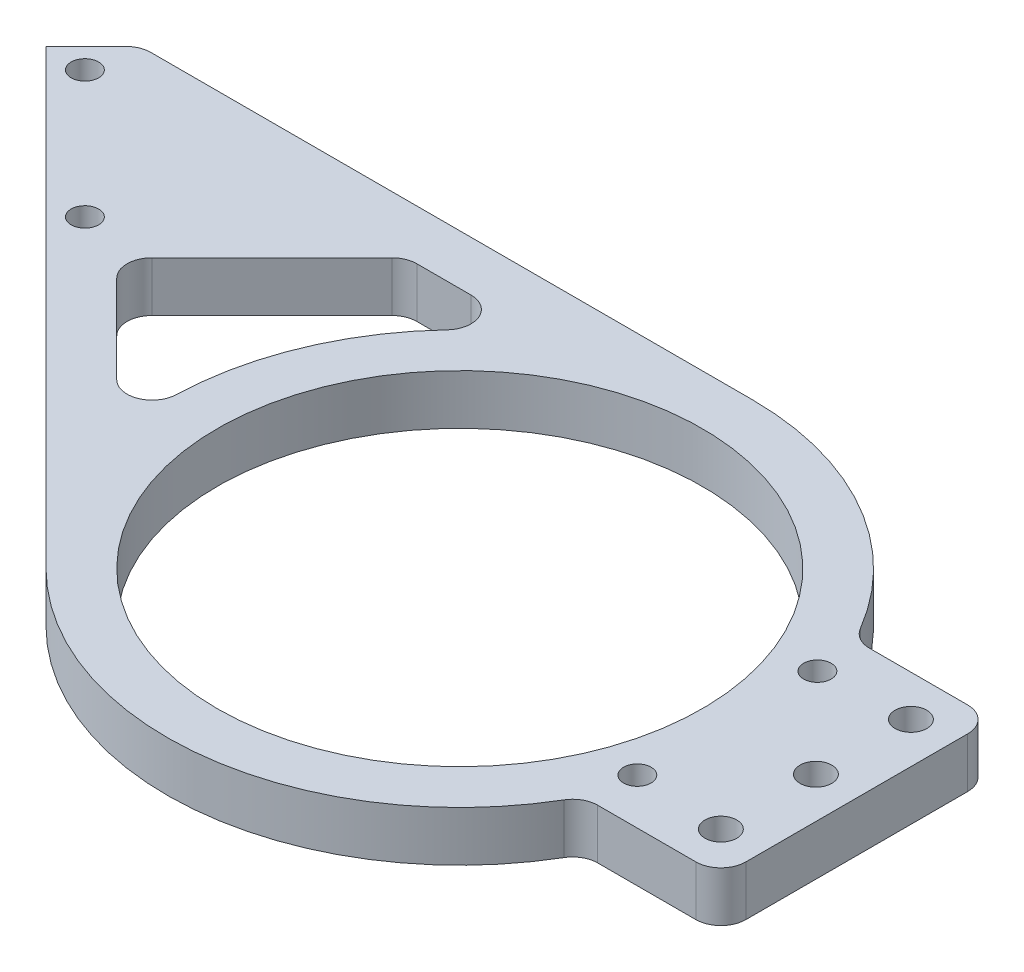
ISO-10303-21;
HEADER;
FILE_DESCRIPTION(('STEP AP214'),'2;1');
FILE_NAME('part.step','',(''),(''),'','','');
FILE_SCHEMA(('AUTOMOTIVE_DESIGN { 1 0 10303 214 1 1 1 1 }'));
ENDSEC;
DATA;
#1=APPLICATION_CONTEXT('core data for automotive mechanical design processes');
#2=APPLICATION_PROTOCOL_DEFINITION('international standard','automotive_design',2000,#1);
#3=PRODUCT_CONTEXT('',#1,'mechanical');
#4=PRODUCT('Part','Part','',(#3));
#5=PRODUCT_RELATED_PRODUCT_CATEGORY('part','',(#4));
#6=PRODUCT_DEFINITION_FORMATION('','',#4);
#7=PRODUCT_DEFINITION_CONTEXT('part definition',#1,'design');
#8=PRODUCT_DEFINITION('design','',#6,#7);
#9=PRODUCT_DEFINITION_SHAPE('','',#8);
#10=(LENGTH_UNIT() NAMED_UNIT(*) SI_UNIT(.MILLI.,.METRE.));
#11=(NAMED_UNIT(*) PLANE_ANGLE_UNIT() SI_UNIT($,.RADIAN.));
#12=(NAMED_UNIT(*) SI_UNIT($,.STERADIAN.) SOLID_ANGLE_UNIT());
#13=UNCERTAINTY_MEASURE_WITH_UNIT(LENGTH_MEASURE(1.E-05),#10,'distance_accuracy_value','');
#14=(GEOMETRIC_REPRESENTATION_CONTEXT(3) GLOBAL_UNCERTAINTY_ASSIGNED_CONTEXT((#13)) GLOBAL_UNIT_ASSIGNED_CONTEXT((#10,
#11,#12)) REPRESENTATION_CONTEXT('',''));
#15=CARTESIAN_POINT('',(0.,0.,0.));
#16=DIRECTION('',(0.,0.,1.));
#17=DIRECTION('',(1.,0.,0.));
#18=AXIS2_PLACEMENT_3D('',#15,#16,#17);
#19=CARTESIAN_POINT('',(-131.787026343642,-5.,-49.0555329448167));
#20=DIRECTION('',(-0.707106781186548,0.,-0.707106781186548));
#21=DIRECTION('',(-0.707106781186548,0.,0.707106781186548));
#22=AXIS2_PLACEMENT_3D('',#19,#20,#21);
#23=PLANE('',#22);
#24=DIRECTION('',(-0.707106781186548,0.,0.707106781186548));
#25=VECTOR('',#24,1.);
#26=CARTESIAN_POINT('',(-131.787026343642,5.,-49.0555329448167));
#27=LINE('',#26,#25);
#28=CARTESIAN_POINT('',(-123.807025382526,5.,-57.0355339059327));
#29=VERTEX_POINT('',#28);
#30=CARTESIAN_POINT('',(-131.787026343642,5.,-49.0555329448167));
#31=VERTEX_POINT('',#30);
#32=EDGE_CURVE('E215',#29,#31,#27,.T.);
#33=ORIENTED_EDGE('',*,*,#32,.F.);
#34=DIRECTION('',(0.,1.,0.));
#35=VECTOR('',#34,1.);
#36=CARTESIAN_POINT('',(-123.807025382526,-5.,-57.0355339059327));
#37=LINE('',#36,#35);
#38=CARTESIAN_POINT('',(-123.807025382526,-5.,-57.0355339059327));
#39=VERTEX_POINT('',#38);
#40=EDGE_CURVE('E182',#29,#39,#37,.F.);
#41=ORIENTED_EDGE('',*,*,#40,.T.);
#42=DIRECTION('',(-0.707106781186548,0.,0.707106781186548));
#43=VECTOR('',#42,1.);
#44=CARTESIAN_POINT('',(-131.787026343642,-5.,-49.0555329448167));
#45=LINE('',#44,#43);
#46=CARTESIAN_POINT('',(-131.787026343642,-5.,-49.0555329448167));
#47=VERTEX_POINT('',#46);
#48=EDGE_CURVE('E177',#39,#47,#45,.T.);
#49=ORIENTED_EDGE('',*,*,#48,.T.);
#50=DIRECTION('',(0.,1.,0.));
#51=VECTOR('',#50,1.);
#52=CARTESIAN_POINT('',(-131.787026343642,-5.,-49.0555329448167));
#53=LINE('',#52,#51);
#54=EDGE_CURVE('E180',#47,#31,#53,.T.);
#55=ORIENTED_EDGE('',*,*,#54,.T.);
#56=EDGE_LOOP('',(#33,#41,#49,#55));
#57=FACE_BOUND('',#56,.T.);
#58=ADVANCED_FACE('F33',(#57),#23,.T.);
#59=CARTESIAN_POINT('',(-122.342559288459,-5.,-58.5));
#60=DIRECTION('',(0.,0.,-1.));
#61=DIRECTION('',(-1.,0.,0.));
#62=AXIS2_PLACEMENT_3D('',#59,#60,#61);
#63=PLANE('',#62);
#64=DIRECTION('',(-1.,0.,0.));
#65=VECTOR('',#64,1.);
#66=CARTESIAN_POINT('',(-122.342559288459,-5.,-58.5));
#67=LINE('',#66,#65);
#68=CARTESIAN_POINT('',(0.,-5.,-58.5));
#69=VERTEX_POINT('',#68);
#70=CARTESIAN_POINT('',(-120.271491476594,-5.,-58.5));
#71=VERTEX_POINT('',#70);
#72=EDGE_CURVE('E195',#69,#71,#67,.T.);
#73=ORIENTED_EDGE('',*,*,#72,.T.);
#74=DIRECTION('',(0.,1.,0.));
#75=VECTOR('',#74,1.);
#76=CARTESIAN_POINT('',(-120.271491476594,-5.,-58.5));
#77=LINE('',#76,#75);
#78=CARTESIAN_POINT('',(-120.271491476594,5.,-58.5));
#79=VERTEX_POINT('',#78);
#80=EDGE_CURVE('E238',#71,#79,#77,.T.);
#81=ORIENTED_EDGE('',*,*,#80,.T.);
#82=DIRECTION('',(-1.,0.,0.));
#83=VECTOR('',#82,1.);
#84=CARTESIAN_POINT('',(-122.342559288459,5.,-58.5));
#85=LINE('',#84,#83);
#86=CARTESIAN_POINT('',(0.,5.,-58.5));
#87=VERTEX_POINT('',#86);
#88=EDGE_CURVE('E186',#87,#79,#85,.T.);
#89=ORIENTED_EDGE('',*,*,#88,.F.);
#90=DIRECTION('',(0.,1.,0.));
#91=VECTOR('',#90,1.);
#92=CARTESIAN_POINT('',(0.,-5.,-58.5));
#93=LINE('',#92,#91);
#94=EDGE_CURVE('E235',#69,#87,#93,.T.);
#95=ORIENTED_EDGE('',*,*,#94,.F.);
#96=EDGE_LOOP('',(#73,#81,#89,#95));
#97=FACE_BOUND('',#96,.T.);
#98=ADVANCED_FACE('F375',(#97),#63,.T.);
#99=CARTESIAN_POINT('',(0.,-5.,0.));
#100=DIRECTION('',(0.,1.,0.));
#101=DIRECTION('',(0.,0.,1.));
#102=AXIS2_PLACEMENT_3D('',#99,#100,#101);
#103=CYLINDRICAL_SURFACE('',#102,58.5);
#104=CARTESIAN_POINT('',(0.,5.,0.));
#105=DIRECTION('',(0.,1.,0.));
#106=DIRECTION('',(0.,0.,1.));
#107=AXIS2_PLACEMENT_3D('',#104,#105,#106);
#108=CIRCLE('',#107,58.5);
#109=CARTESIAN_POINT('',(50.4344066800632,5.,-29.6415354330709));
#110=VERTEX_POINT('',#109);
#111=EDGE_CURVE('E231',#110,#87,#108,.T.);
#112=ORIENTED_EDGE('',*,*,#111,.F.);
#113=DIRECTION('',(0.,1.,0.));
#114=VECTOR('',#113,1.);
#115=CARTESIAN_POINT('',(50.4344066800632,-5.,-29.6415354330709));
#116=LINE('',#115,#114);
#117=CARTESIAN_POINT('',(50.4344066800632,-5.,-29.6415354330709));
#118=VERTEX_POINT('',#117);
#119=EDGE_CURVE('E272',#110,#118,#116,.F.);
#120=ORIENTED_EDGE('',*,*,#119,.T.);
#121=CARTESIAN_POINT('',(0.,-5.,0.));
#122=DIRECTION('',(0.,1.,0.));
#123=DIRECTION('',(0.,0.,1.));
#124=AXIS2_PLACEMENT_3D('',#121,#122,#123);
#125=CIRCLE('',#124,58.5);
#126=EDGE_CURVE('E211',#118,#69,#125,.T.);
#127=ORIENTED_EDGE('',*,*,#126,.T.);
#128=ORIENTED_EDGE('',*,*,#94,.T.);
#129=EDGE_LOOP('',(#112,#120,#127,#128));
#130=FACE_BOUND('',#129,.T.);
#131=ADVANCED_FACE('F426',(#130),#103,.T.);
#132=CARTESIAN_POINT('',(51.8051095452949,-5.,-27.175));
#133=DIRECTION('',(0.,0.,-1.));
#134=DIRECTION('',(-1.,0.,0.));
#135=AXIS2_PLACEMENT_3D('',#132,#133,#134);
#136=PLANE('',#135);
#137=DIRECTION('',(-1.,0.,0.));
#138=VECTOR('',#137,1.);
#139=CARTESIAN_POINT('',(51.8051095452949,5.,-27.175));
#140=LINE('',#139,#138);
#141=CARTESIAN_POINT('',(74.375,5.,-27.175));
#142=VERTEX_POINT('',#141);
#143=CARTESIAN_POINT('',(54.7450397296413,5.,-27.175));
#144=VERTEX_POINT('',#143);
#145=EDGE_CURVE('E228',#142,#144,#140,.T.);
#146=ORIENTED_EDGE('',*,*,#145,.F.);
#147=DIRECTION('',(0.,1.,0.));
#148=VECTOR('',#147,1.);
#149=CARTESIAN_POINT('',(74.375,-5.,-27.175));
#150=LINE('',#149,#148);
#151=CARTESIAN_POINT('',(74.375,-5.,-27.175));
#152=VERTEX_POINT('',#151);
#153=EDGE_CURVE('E262',#142,#152,#150,.F.);
#154=ORIENTED_EDGE('',*,*,#153,.T.);
#155=DIRECTION('',(-1.,0.,0.));
#156=VECTOR('',#155,1.);
#157=CARTESIAN_POINT('',(51.8051095452949,-5.,-27.175));
#158=LINE('',#157,#156);
#159=CARTESIAN_POINT('',(54.7450397296413,-5.,-27.175));
#160=VERTEX_POINT('',#159);
#161=EDGE_CURVE('E208',#152,#160,#158,.T.);
#162=ORIENTED_EDGE('',*,*,#161,.T.);
#163=DIRECTION('',(0.,-1.,0.));
#164=VECTOR('',#163,1.);
#165=CARTESIAN_POINT('',(54.7450397296413,5.,-27.175));
#166=LINE('',#165,#164);
#167=EDGE_CURVE('E259',#160,#144,#166,.F.);
#168=ORIENTED_EDGE('',*,*,#167,.T.);
#169=EDGE_LOOP('',(#146,#154,#162,#168));
#170=FACE_BOUND('',#169,.T.);
#171=ADVANCED_FACE('F390',(#170),#136,.T.);
#172=CARTESIAN_POINT('',(79.375,-5.,-27.175));
#173=DIRECTION('',(1.,0.,0.));
#174=DIRECTION('',(0.,0.,-1.));
#175=AXIS2_PLACEMENT_3D('',#172,#173,#174);
#176=PLANE('',#175);
#177=DIRECTION('',(0.,0.,-1.));
#178=VECTOR('',#177,1.);
#179=CARTESIAN_POINT('',(79.375,-5.,-27.175));
#180=LINE('',#179,#178);
#181=CARTESIAN_POINT('',(79.375,-5.,22.175));
#182=VERTEX_POINT('',#181);
#183=CARTESIAN_POINT('',(79.375,-5.,-22.175));
#184=VERTEX_POINT('',#183);
#185=EDGE_CURVE('E205',#182,#184,#180,.T.);
#186=ORIENTED_EDGE('',*,*,#185,.T.);
#187=DIRECTION('',(0.,1.,0.));
#188=VECTOR('',#187,1.);
#189=CARTESIAN_POINT('',(79.375,-5.,-22.175));
#190=LINE('',#189,#188);
#191=CARTESIAN_POINT('',(79.375,5.,-22.175));
#192=VERTEX_POINT('',#191);
#193=EDGE_CURVE('E256',#184,#192,#190,.T.);
#194=ORIENTED_EDGE('',*,*,#193,.T.);
#195=DIRECTION('',(0.,0.,-1.));
#196=VECTOR('',#195,1.);
#197=CARTESIAN_POINT('',(79.375,5.,-27.175));
#198=LINE('',#197,#196);
#199=CARTESIAN_POINT('',(79.375,5.,22.175));
#200=VERTEX_POINT('',#199);
#201=EDGE_CURVE('E225',#200,#192,#198,.T.);
#202=ORIENTED_EDGE('',*,*,#201,.F.);
#203=DIRECTION('',(0.,1.,0.));
#204=VECTOR('',#203,1.);
#205=CARTESIAN_POINT('',(79.375,-5.,22.175));
#206=LINE('',#205,#204);
#207=EDGE_CURVE('E254',#200,#182,#206,.F.);
#208=ORIENTED_EDGE('',*,*,#207,.T.);
#209=EDGE_LOOP('',(#186,#194,#202,#208));
#210=FACE_BOUND('',#209,.T.);
#211=ADVANCED_FACE('F398',(#210),#176,.T.);
#212=CARTESIAN_POINT('',(51.8051095452949,-5.,27.175));
#213=DIRECTION('',(0.,0.,1.));
#214=DIRECTION('',(1.,0.,0.));
#215=AXIS2_PLACEMENT_3D('',#212,#213,#214);
#216=PLANE('',#215);
#217=DIRECTION('',(1.,0.,0.));
#218=VECTOR('',#217,1.);
#219=CARTESIAN_POINT('',(51.8051095452949,-5.,27.175));
#220=LINE('',#219,#218);
#221=CARTESIAN_POINT('',(54.7450397296413,-5.,27.175));
#222=VERTEX_POINT('',#221);
#223=CARTESIAN_POINT('',(74.375,-5.,27.175));
#224=VERTEX_POINT('',#223);
#225=EDGE_CURVE('E200',#222,#224,#220,.T.);
#226=ORIENTED_EDGE('',*,*,#225,.T.);
#227=DIRECTION('',(0.,1.,0.));
#228=VECTOR('',#227,1.);
#229=CARTESIAN_POINT('',(74.375,-5.,27.175));
#230=LINE('',#229,#228);
#231=CARTESIAN_POINT('',(74.375,5.,27.175));
#232=VERTEX_POINT('',#231);
#233=EDGE_CURVE('E266',#224,#232,#230,.T.);
#234=ORIENTED_EDGE('',*,*,#233,.T.);
#235=DIRECTION('',(1.,0.,0.));
#236=VECTOR('',#235,1.);
#237=CARTESIAN_POINT('',(51.8051095452949,5.,27.175));
#238=LINE('',#237,#236);
#239=CARTESIAN_POINT('',(54.7450397296413,5.,27.175));
#240=VERTEX_POINT('',#239);
#241=EDGE_CURVE('E222',#240,#232,#238,.T.);
#242=ORIENTED_EDGE('',*,*,#241,.F.);
#243=DIRECTION('',(0.,-1.,0.));
#244=VECTOR('',#243,1.);
#245=CARTESIAN_POINT('',(54.7450397296413,-5.,27.175));
#246=LINE('',#245,#244);
#247=EDGE_CURVE('E264',#240,#222,#246,.T.);
#248=ORIENTED_EDGE('',*,*,#247,.T.);
#249=EDGE_LOOP('',(#226,#234,#242,#248));
#250=FACE_BOUND('',#249,.T.);
#251=ADVANCED_FACE('F405',(#250),#216,.T.);
#252=CARTESIAN_POINT('',(0.,-5.,0.));
#253=DIRECTION('',(0.,1.,0.));
#254=DIRECTION('',(0.,0.,1.));
#255=AXIS2_PLACEMENT_3D('',#252,#253,#254);
#256=CYLINDRICAL_SURFACE('',#255,58.5);
#257=CARTESIAN_POINT('',(0.,-5.,0.));
#258=DIRECTION('',(0.,1.,0.));
#259=DIRECTION('',(0.,0.,1.));
#260=AXIS2_PLACEMENT_3D('',#257,#258,#259);
#261=CIRCLE('',#260,58.5);
#262=CARTESIAN_POINT('',(-41.365746699413,-5.,41.365746699413));
#263=VERTEX_POINT('',#262);
#264=CARTESIAN_POINT('',(50.4344066800632,-5.,29.6415354330709));
#265=VERTEX_POINT('',#264);
#266=EDGE_CURVE('E198',#263,#265,#261,.T.);
#267=ORIENTED_EDGE('',*,*,#266,.T.);
#268=DIRECTION('',(0.,1.,0.));
#269=VECTOR('',#268,1.);
#270=CARTESIAN_POINT('',(50.4344066800632,-5.,29.6415354330709));
#271=LINE('',#270,#269);
#272=CARTESIAN_POINT('',(50.4344066800632,5.,29.6415354330709));
#273=VERTEX_POINT('',#272);
#274=EDGE_CURVE('E269',#265,#273,#271,.T.);
#275=ORIENTED_EDGE('',*,*,#274,.T.);
#276=CARTESIAN_POINT('',(0.,5.,0.));
#277=DIRECTION('',(0.,1.,0.));
#278=DIRECTION('',(0.,0.,1.));
#279=AXIS2_PLACEMENT_3D('',#276,#277,#278);
#280=CIRCLE('',#279,58.5);
#281=CARTESIAN_POINT('',(-41.365746699413,5.,41.365746699413));
#282=VERTEX_POINT('',#281);
#283=EDGE_CURVE('E219',#282,#273,#280,.T.);
#284=ORIENTED_EDGE('',*,*,#283,.F.);
#285=DIRECTION('',(0.,1.,0.));
#286=VECTOR('',#285,1.);
#287=CARTESIAN_POINT('',(-41.365746699413,-5.,41.365746699413));
#288=LINE('',#287,#286);
#289=EDGE_CURVE('E194',#263,#282,#288,.T.);
#290=ORIENTED_EDGE('',*,*,#289,.F.);
#291=EDGE_LOOP('',(#267,#275,#284,#290));
#292=FACE_BOUND('',#291,.T.);
#293=ADVANCED_FACE('F412',(#292),#256,.T.);
#294=CARTESIAN_POINT('',(-102.265318229104,-5.,-19.5338248302783));
#295=DIRECTION('',(-0.707106781186549,0.,0.707106781186546));
#296=DIRECTION('',(0.707106781186546,0.,0.707106781186549));
#297=AXIS2_PLACEMENT_3D('',#294,#295,#296);
#298=PLANE('',#297);
#299=DIRECTION('',(0.707106781186546,0.,0.707106781186549));
#300=VECTOR('',#299,1.);
#301=CARTESIAN_POINT('',(-102.265318229104,5.,-19.5338248302783));
#302=LINE('',#301,#300);
#303=EDGE_CURVE('E193',#31,#282,#302,.T.);
#304=ORIENTED_EDGE('',*,*,#303,.F.);
#305=ORIENTED_EDGE('',*,*,#54,.F.);
#306=DIRECTION('',(0.707106781186547,0.,0.707106781186547));
#307=VECTOR('',#306,1.);
#308=CARTESIAN_POINT('',(-131.787026343642,-5.,-49.0555329448167));
#309=LINE('',#308,#307);
#310=EDGE_CURVE('E185',#47,#263,#309,.T.);
#311=ORIENTED_EDGE('',*,*,#310,.T.);
#312=ORIENTED_EDGE('',*,*,#289,.T.);
#313=EDGE_LOOP('',(#304,#305,#311,#312));
#314=FACE_BOUND('',#313,.T.);
#315=ADVANCED_FACE('F190',(#314),#298,.T.);
#316=CARTESIAN_POINT('',(0.,-5.,0.));
#317=DIRECTION('',(0.,1.,0.));
#318=DIRECTION('',(0.,0.,1.));
#319=AXIS2_PLACEMENT_3D('',#316,#317,#318);
#320=PLANE('',#319);
#321=CARTESIAN_POINT('',(71.2,-5.,-19.));
#322=DIRECTION('',(0.,1.,0.));
#323=DIRECTION('',(0.,0.,1.));
#324=AXIS2_PLACEMENT_3D('',#321,#322,#323);
#325=CIRCLE('',#324,3.175);
#326=CARTESIAN_POINT('',(71.2,-5.,-15.825));
#327=VERTEX_POINT('',#326);
#328=EDGE_CURVE('E498',#327,#327,#325,.T.);
#329=ORIENTED_EDGE('',*,*,#328,.T.);
#330=EDGE_LOOP('',(#329));
#331=FACE_BOUND('',#330,.T.);
#332=CARTESIAN_POINT('',(71.2,-5.,0.));
#333=DIRECTION('',(0.,1.,0.));
#334=DIRECTION('',(0.,0.,1.));
#335=AXIS2_PLACEMENT_3D('',#332,#333,#334);
#336=CIRCLE('',#335,3.175);
#337=CARTESIAN_POINT('',(71.2,-5.,3.175));
#338=VERTEX_POINT('',#337);
#339=EDGE_CURVE('E492',#338,#338,#336,.T.);
#340=ORIENTED_EDGE('',*,*,#339,.T.);
#341=EDGE_LOOP('',(#340));
#342=FACE_BOUND('',#341,.T.);
#343=CARTESIAN_POINT('',(71.2,-5.,19.));
#344=DIRECTION('',(0.,1.,0.));
#345=DIRECTION('',(0.,0.,1.));
#346=AXIS2_PLACEMENT_3D('',#343,#344,#345);
#347=CIRCLE('',#346,3.175);
#348=CARTESIAN_POINT('',(71.2,-5.,22.175));
#349=VERTEX_POINT('',#348);
#350=EDGE_CURVE('E484',#349,#349,#347,.T.);
#351=ORIENTED_EDGE('',*,*,#350,.T.);
#352=EDGE_LOOP('',(#351));
#353=FACE_BOUND('',#352,.T.);
#354=CARTESIAN_POINT('',(53.5,-5.,-18.));
#355=DIRECTION('',(0.,1.,0.));
#356=DIRECTION('',(0.,0.,1.));
#357=AXIS2_PLACEMENT_3D('',#354,#355,#356);
#358=CIRCLE('',#357,2.75);
#359=CARTESIAN_POINT('',(53.5,-5.,-15.25));
#360=VERTEX_POINT('',#359);
#361=EDGE_CURVE('E478',#360,#360,#358,.T.);
#362=ORIENTED_EDGE('',*,*,#361,.T.);
#363=EDGE_LOOP('',(#362));
#364=FACE_BOUND('',#363,.T.);
#365=CARTESIAN_POINT('',(53.5,-5.,18.));
#366=DIRECTION('',(0.,1.,0.));
#367=DIRECTION('',(0.,0.,-1.));
#368=AXIS2_PLACEMENT_3D('',#365,#366,#367);
#369=CIRCLE('',#368,2.75);
#370=CARTESIAN_POINT('',(53.5,-5.,15.25));
#371=VERTEX_POINT('',#370);
#372=EDGE_CURVE('E472',#371,#371,#369,.T.);
#373=ORIENTED_EDGE('',*,*,#372,.T.);
#374=EDGE_LOOP('',(#373));
#375=FACE_BOUND('',#374,.T.);
#376=CARTESIAN_POINT('',(-98.3762309325781,-5.,-23.4229121268044));
#377=DIRECTION('',(0.,1.,0.));
#378=DIRECTION('',(0.,0.,1.));
#379=AXIS2_PLACEMENT_3D('',#376,#377,#378);
#380=CIRCLE('',#379,2.75000000000001);
#381=CARTESIAN_POINT('',(-98.3762309325781,-5.,-20.6729121268044));
#382=VERTEX_POINT('',#381);
#383=EDGE_CURVE('E466',#382,#382,#380,.T.);
#384=ORIENTED_EDGE('',*,*,#383,.T.);
#385=EDGE_LOOP('',(#384));
#386=FACE_BOUND('',#385,.T.);
#387=CARTESIAN_POINT('',(-123.832075055294,-5.,-48.8787562495201));
#388=DIRECTION('',(0.,1.,0.));
#389=DIRECTION('',(0.,0.,1.));
#390=AXIS2_PLACEMENT_3D('',#387,#388,#389);
#391=CIRCLE('',#390,2.75000000000001);
#392=CARTESIAN_POINT('',(-123.832075055294,-5.,-46.1287562495201));
#393=VERTEX_POINT('',#392);
#394=EDGE_CURVE('E353',#393,#393,#391,.T.);
#395=ORIENTED_EDGE('',*,*,#394,.T.);
#396=EDGE_LOOP('',(#395));
#397=FACE_BOUND('',#396,.T.);
#398=CARTESIAN_POINT('',(0.,-5.,0.));
#399=DIRECTION('',(0.,-1.,0.));
#400=DIRECTION('',(0.,0.,1.));
#401=AXIS2_PLACEMENT_3D('',#398,#399,#400);
#402=CIRCLE('',#401,58.5);
#403=CARTESIAN_POINT('',(-58.472361697301,-5.,-1.79803157369585));
#404=VERTEX_POINT('',#403);
#405=CARTESIAN_POINT('',(-42.6176037867019,-5.,-40.0748031496063));
#406=VERTEX_POINT('',#405);
#407=EDGE_CURVE('E339',#404,#406,#402,.T.);
#408=ORIENTED_EDGE('',*,*,#407,.T.);
#409=CARTESIAN_POINT('',(-46.2601340248815,-5.,-43.5));
#410=DIRECTION('',(0.,1.,0.));
#411=DIRECTION('',(0.,0.,1.));
#412=AXIS2_PLACEMENT_3D('',#409,#410,#411);
#413=CIRCLE('',#412,5.);
#414=CARTESIAN_POINT('',(-46.2601340248815,-5.,-48.5));
#415=VERTEX_POINT('',#414);
#416=EDGE_CURVE('E11',#406,#415,#413,.T.);
#417=ORIENTED_EDGE('',*,*,#416,.T.);
#418=DIRECTION('',(-1.,0.,0.));
#419=VECTOR('',#418,1.);
#420=CARTESIAN_POINT('',(-59.1570074356515,-5.,-48.5));
#421=LINE('',#420,#419);
#422=CARTESIAN_POINT('',(-57.085939623786,-5.,-48.5));
#423=VERTEX_POINT('',#422);
#424=EDGE_CURVE('E337',#415,#423,#421,.T.);
#425=ORIENTED_EDGE('',*,*,#424,.T.);
#426=CARTESIAN_POINT('',(-57.085939623786,-5.,-43.5));
#427=DIRECTION('',(0.,1.,0.));
#428=DIRECTION('',(0.,0.,1.));
#429=AXIS2_PLACEMENT_3D('',#426,#427,#428);
#430=CIRCLE('',#429,5.);
#431=CARTESIAN_POINT('',(-60.6214735297188,-5.,-47.0355339059327));
#432=VERTEX_POINT('',#431);
#433=EDGE_CURVE('E307',#423,#432,#430,.T.);
#434=ORIENTED_EDGE('',*,*,#433,.T.);
#435=DIRECTION('',(-0.707106781186547,0.,0.707106781186547));
#436=VECTOR('',#435,1.);
#437=CARTESIAN_POINT('',(-88.1231826053731,-5.,-19.5338248302784));
#438=LINE('',#437,#436);
#439=CARTESIAN_POINT('',(-84.5876486994404,-5.,-23.0693587362111));
#440=VERTEX_POINT('',#439);
#441=EDGE_CURVE('E357',#432,#440,#438,.T.);
#442=ORIENTED_EDGE('',*,*,#441,.T.);
#443=CARTESIAN_POINT('',(-81.0521147935077,-5.,-19.5338248302784));
#444=DIRECTION('',(0.,1.,0.));
#445=DIRECTION('',(0.,0.,1.));
#446=AXIS2_PLACEMENT_3D('',#443,#444,#445);
#447=CIRCLE('',#446,5.);
#448=CARTESIAN_POINT('',(-84.5876486994404,-5.,-15.9982909243457));
#449=VERTEX_POINT('',#448);
#450=EDGE_CURVE('E303',#440,#449,#447,.T.);
#451=ORIENTED_EDGE('',*,*,#450,.T.);
#452=DIRECTION('',(0.707106781186543,0.,0.707106781186552));
#453=VECTOR('',#452,1.);
#454=CARTESIAN_POINT('',(-88.1231826053731,-5.,-19.5338248302784));
#455=LINE('',#454,#453);
#456=CARTESIAN_POINT('',(-67.0055333551398,-5.,1.58382441995517));
#457=VERTEX_POINT('',#456);
#458=EDGE_CURVE('E346',#449,#457,#455,.T.);
#459=ORIENTED_EDGE('',*,*,#458,.T.);
#460=CARTESIAN_POINT('',(-63.4699994492071,-5.,-1.95170948597755));
#461=DIRECTION('',(0.,1.,0.));
#462=DIRECTION('',(0.,0.,1.));
#463=AXIS2_PLACEMENT_3D('',#460,#461,#462);
#464=CIRCLE('',#463,5.);
#465=EDGE_CURVE('E311',#457,#404,#464,.T.);
#466=ORIENTED_EDGE('',*,*,#465,.T.);
#467=EDGE_LOOP('',(#408,#417,#425,#434,#442,#451,#459,#466));
#468=FACE_BOUND('',#467,.T.);
#469=CARTESIAN_POINT('',(0.,-5.,0.));
#470=DIRECTION('',(0.,1.,0.));
#471=DIRECTION('',(0.,0.,1.));
#472=AXIS2_PLACEMENT_3D('',#469,#470,#471);
#473=CIRCLE('',#472,48.5);
#474=CARTESIAN_POINT('',(0.,-5.,48.5));
#475=VERTEX_POINT('',#474);
#476=EDGE_CURVE('E217',#475,#475,#473,.T.);
#477=ORIENTED_EDGE('',*,*,#476,.T.);
#478=EDGE_LOOP('',(#477));
#479=FACE_BOUND('',#478,.T.);
#480=ORIENTED_EDGE('',*,*,#48,.F.);
#481=CARTESIAN_POINT('',(-120.271491476594,-5.,-53.5));
#482=DIRECTION('',(0.,1.,0.));
#483=DIRECTION('',(0.,0.,1.));
#484=AXIS2_PLACEMENT_3D('',#481,#482,#483);
#485=CIRCLE('',#484,5.);
#486=EDGE_CURVE('E252',#39,#71,#485,.F.);
#487=ORIENTED_EDGE('',*,*,#486,.T.);
#488=ORIENTED_EDGE('',*,*,#72,.F.);
#489=ORIENTED_EDGE('',*,*,#126,.F.);
#490=CARTESIAN_POINT('',(54.7450397296413,-5.,-32.175));
#491=DIRECTION('',(0.,1.,0.));
#492=DIRECTION('',(0.,0.,1.));
#493=AXIS2_PLACEMENT_3D('',#490,#491,#492);
#494=CIRCLE('',#493,5.);
#495=EDGE_CURVE('E299',#118,#160,#494,.T.);
#496=ORIENTED_EDGE('',*,*,#495,.T.);
#497=ORIENTED_EDGE('',*,*,#161,.F.);
#498=CARTESIAN_POINT('',(74.375,-5.,-22.175));
#499=DIRECTION('',(0.,1.,0.));
#500=DIRECTION('',(0.,0.,1.));
#501=AXIS2_PLACEMENT_3D('',#498,#499,#500);
#502=CIRCLE('',#501,5.);
#503=EDGE_CURVE('E250',#152,#184,#502,.F.);
#504=ORIENTED_EDGE('',*,*,#503,.T.);
#505=ORIENTED_EDGE('',*,*,#185,.F.);
#506=CARTESIAN_POINT('',(74.375,-5.,22.175));
#507=DIRECTION('',(0.,1.,0.));
#508=DIRECTION('',(0.,0.,1.));
#509=AXIS2_PLACEMENT_3D('',#506,#507,#508);
#510=CIRCLE('',#509,5.);
#511=EDGE_CURVE('E54',#182,#224,#510,.F.);
#512=ORIENTED_EDGE('',*,*,#511,.T.);
#513=ORIENTED_EDGE('',*,*,#225,.F.);
#514=CARTESIAN_POINT('',(54.7450397296413,-5.,32.175));
#515=DIRECTION('',(0.,1.,0.));
#516=DIRECTION('',(0.,0.,1.));
#517=AXIS2_PLACEMENT_3D('',#514,#515,#516);
#518=CIRCLE('',#517,5.);
#519=EDGE_CURVE('E48',#222,#265,#518,.T.);
#520=ORIENTED_EDGE('',*,*,#519,.T.);
#521=ORIENTED_EDGE('',*,*,#266,.F.);
#522=ORIENTED_EDGE('',*,*,#310,.F.);
#523=EDGE_LOOP('',(#480,#487,#488,#489,#496,#497,#504,#505,#512,#513,#520,#521,#522));
#524=FACE_BOUND('',#523,.T.);
#525=ADVANCED_FACE('F197',(#331,#342,#353,#364,#375,#386,#397,#468,#479,#524),#320,.F.);
#526=CARTESIAN_POINT('',(0.,5.,0.));
#527=DIRECTION('',(0.,1.,0.));
#528=DIRECTION('',(0.,0.,1.));
#529=AXIS2_PLACEMENT_3D('',#526,#527,#528);
#530=PLANE('',#529);
#531=CARTESIAN_POINT('',(71.2,5.,-19.));
#532=DIRECTION('',(0.,1.,0.));
#533=DIRECTION('',(0.,0.,1.));
#534=AXIS2_PLACEMENT_3D('',#531,#532,#533);
#535=CIRCLE('',#534,3.17499999999998);
#536=CARTESIAN_POINT('',(71.2,5.,-15.8250000000001));
#537=VERTEX_POINT('',#536);
#538=EDGE_CURVE('E501',#537,#537,#535,.T.);
#539=ORIENTED_EDGE('',*,*,#538,.F.);
#540=EDGE_LOOP('',(#539));
#541=FACE_BOUND('',#540,.T.);
#542=CARTESIAN_POINT('',(71.2,5.,0.));
#543=DIRECTION('',(0.,1.,0.));
#544=DIRECTION('',(0.,0.,1.));
#545=AXIS2_PLACEMENT_3D('',#542,#543,#544);
#546=CIRCLE('',#545,3.17499999999998);
#547=CARTESIAN_POINT('',(71.2,5.,3.17499999999998));
#548=VERTEX_POINT('',#547);
#549=EDGE_CURVE('E495',#548,#548,#546,.T.);
#550=ORIENTED_EDGE('',*,*,#549,.F.);
#551=EDGE_LOOP('',(#550));
#552=FACE_BOUND('',#551,.T.);
#553=CARTESIAN_POINT('',(71.2,5.,19.));
#554=DIRECTION('',(0.,1.,0.));
#555=DIRECTION('',(0.,0.,1.));
#556=AXIS2_PLACEMENT_3D('',#553,#554,#555);
#557=CIRCLE('',#556,3.17499999999998);
#558=CARTESIAN_POINT('',(71.2,5.,22.175));
#559=VERTEX_POINT('',#558);
#560=EDGE_CURVE('E489',#559,#559,#557,.T.);
#561=ORIENTED_EDGE('',*,*,#560,.F.);
#562=EDGE_LOOP('',(#561));
#563=FACE_BOUND('',#562,.T.);
#564=CARTESIAN_POINT('',(53.5,5.,-18.));
#565=DIRECTION('',(0.,1.,0.));
#566=DIRECTION('',(0.,0.,1.));
#567=AXIS2_PLACEMENT_3D('',#564,#565,#566);
#568=CIRCLE('',#567,2.75);
#569=CARTESIAN_POINT('',(53.5,5.,-15.25));
#570=VERTEX_POINT('',#569);
#571=EDGE_CURVE('E481',#570,#570,#568,.T.);
#572=ORIENTED_EDGE('',*,*,#571,.F.);
#573=EDGE_LOOP('',(#572));
#574=FACE_BOUND('',#573,.T.);
#575=CARTESIAN_POINT('',(53.5,5.,18.));
#576=DIRECTION('',(0.,1.,0.));
#577=DIRECTION('',(0.,0.,-1.));
#578=AXIS2_PLACEMENT_3D('',#575,#576,#577);
#579=CIRCLE('',#578,2.75);
#580=CARTESIAN_POINT('',(53.5,5.,15.25));
#581=VERTEX_POINT('',#580);
#582=EDGE_CURVE('E475',#581,#581,#579,.T.);
#583=ORIENTED_EDGE('',*,*,#582,.F.);
#584=EDGE_LOOP('',(#583));
#585=FACE_BOUND('',#584,.T.);
#586=CARTESIAN_POINT('',(-98.3762309325781,5.,-23.4229121268044));
#587=DIRECTION('',(0.,1.,0.));
#588=DIRECTION('',(0.,0.,1.));
#589=AXIS2_PLACEMENT_3D('',#586,#587,#588);
#590=CIRCLE('',#589,2.75000000000001);
#591=CARTESIAN_POINT('',(-98.3762309325781,5.,-20.6729121268044));
#592=VERTEX_POINT('',#591);
#593=EDGE_CURVE('E469',#592,#592,#590,.T.);
#594=ORIENTED_EDGE('',*,*,#593,.F.);
#595=EDGE_LOOP('',(#594));
#596=FACE_BOUND('',#595,.T.);
#597=CARTESIAN_POINT('',(-123.832075055294,5.,-48.8787562495201));
#598=DIRECTION('',(0.,1.,0.));
#599=DIRECTION('',(0.,0.,1.));
#600=AXIS2_PLACEMENT_3D('',#597,#598,#599);
#601=CIRCLE('',#600,2.75000000000001);
#602=CARTESIAN_POINT('',(-123.832075055294,5.,-46.1287562495201));
#603=VERTEX_POINT('',#602);
#604=EDGE_CURVE('E463',#603,#603,#601,.T.);
#605=ORIENTED_EDGE('',*,*,#604,.F.);
#606=EDGE_LOOP('',(#605));
#607=FACE_BOUND('',#606,.T.);
#608=DIRECTION('',(-0.707106781186547,0.,0.707106781186547));
#609=VECTOR('',#608,1.);
#610=CARTESIAN_POINT('',(-88.1231826053731,5.,-19.5338248302784));
#611=LINE('',#610,#609);
#612=CARTESIAN_POINT('',(-60.6214735297188,5.,-47.0355339059327));
#613=VERTEX_POINT('',#612);
#614=CARTESIAN_POINT('',(-84.5876486994404,5.,-23.0693587362111));
#615=VERTEX_POINT('',#614);
#616=EDGE_CURVE('E350',#613,#615,#611,.T.);
#617=ORIENTED_EDGE('',*,*,#616,.F.);
#618=CARTESIAN_POINT('',(-57.085939623786,5.,-43.5));
#619=DIRECTION('',(0.,1.,0.));
#620=DIRECTION('',(0.,0.,1.));
#621=AXIS2_PLACEMENT_3D('',#618,#619,#620);
#622=CIRCLE('',#621,5.);
#623=CARTESIAN_POINT('',(-57.085939623786,5.,-48.5));
#624=VERTEX_POINT('',#623);
#625=EDGE_CURVE('E305',#613,#624,#622,.F.);
#626=ORIENTED_EDGE('',*,*,#625,.T.);
#627=DIRECTION('',(-1.,0.,0.));
#628=VECTOR('',#627,1.);
#629=CARTESIAN_POINT('',(-59.1570074356515,5.,-48.5));
#630=LINE('',#629,#628);
#631=CARTESIAN_POINT('',(-46.2601340248815,5.,-48.5));
#632=VERTEX_POINT('',#631);
#633=EDGE_CURVE('E321',#632,#624,#630,.T.);
#634=ORIENTED_EDGE('',*,*,#633,.F.);
#635=CARTESIAN_POINT('',(-46.2601340248815,5.,-43.5));
#636=DIRECTION('',(0.,1.,0.));
#637=DIRECTION('',(0.,0.,1.));
#638=AXIS2_PLACEMENT_3D('',#635,#636,#637);
#639=CIRCLE('',#638,5.);
#640=CARTESIAN_POINT('',(-42.6176037867019,5.,-40.0748031496063));
#641=VERTEX_POINT('',#640);
#642=EDGE_CURVE('E41',#632,#641,#639,.F.);
#643=ORIENTED_EDGE('',*,*,#642,.T.);
#644=CARTESIAN_POINT('',(0.,5.,0.));
#645=DIRECTION('',(0.,-1.,0.));
#646=DIRECTION('',(0.,0.,1.));
#647=AXIS2_PLACEMENT_3D('',#644,#645,#646);
#648=CIRCLE('',#647,58.5);
#649=CARTESIAN_POINT('',(-58.472361697301,5.,-1.79803157369585));
#650=VERTEX_POINT('',#649);
#651=EDGE_CURVE('E319',#650,#641,#648,.T.);
#652=ORIENTED_EDGE('',*,*,#651,.F.);
#653=CARTESIAN_POINT('',(-63.4699994492071,5.,-1.95170948597755));
#654=DIRECTION('',(0.,1.,0.));
#655=DIRECTION('',(0.,0.,1.));
#656=AXIS2_PLACEMENT_3D('',#653,#654,#655);
#657=CIRCLE('',#656,5.);
#658=CARTESIAN_POINT('',(-67.0055333551398,5.,1.58382441995517));
#659=VERTEX_POINT('',#658);
#660=EDGE_CURVE('E309',#650,#659,#657,.F.);
#661=ORIENTED_EDGE('',*,*,#660,.T.);
#662=DIRECTION('',(0.707106781186543,0.,0.707106781186552));
#663=VECTOR('',#662,1.);
#664=CARTESIAN_POINT('',(-88.1231826053731,5.,-19.5338248302784));
#665=LINE('',#664,#663);
#666=CARTESIAN_POINT('',(-84.5876486994404,5.,-15.9982909243457));
#667=VERTEX_POINT('',#666);
#668=EDGE_CURVE('E330',#667,#659,#665,.T.);
#669=ORIENTED_EDGE('',*,*,#668,.F.);
#670=CARTESIAN_POINT('',(-81.0521147935077,5.,-19.5338248302784));
#671=DIRECTION('',(0.,1.,0.));
#672=DIRECTION('',(0.,0.,1.));
#673=AXIS2_PLACEMENT_3D('',#670,#671,#672);
#674=CIRCLE('',#673,5.);
#675=EDGE_CURVE('E301',#667,#615,#674,.F.);
#676=ORIENTED_EDGE('',*,*,#675,.T.);
#677=EDGE_LOOP('',(#617,#626,#634,#643,#652,#661,#669,#676));
#678=FACE_BOUND('',#677,.T.);
#679=CARTESIAN_POINT('',(0.,5.,0.));
#680=DIRECTION('',(0.,1.,0.));
#681=DIRECTION('',(0.,0.,1.));
#682=AXIS2_PLACEMENT_3D('',#679,#680,#681);
#683=CIRCLE('',#682,48.5);
#684=CARTESIAN_POINT('',(0.,5.,48.5));
#685=VERTEX_POINT('',#684);
#686=EDGE_CURVE('E343',#685,#685,#683,.T.);
#687=ORIENTED_EDGE('',*,*,#686,.F.);
#688=EDGE_LOOP('',(#687));
#689=FACE_BOUND('',#688,.T.);
#690=ORIENTED_EDGE('',*,*,#88,.T.);
#691=CARTESIAN_POINT('',(-120.271491476594,5.,-53.5));
#692=DIRECTION('',(0.,1.,0.));
#693=DIRECTION('',(0.,0.,1.));
#694=AXIS2_PLACEMENT_3D('',#691,#692,#693);
#695=CIRCLE('',#694,5.);
#696=EDGE_CURVE('E246',#79,#29,#695,.T.);
#697=ORIENTED_EDGE('',*,*,#696,.T.);
#698=ORIENTED_EDGE('',*,*,#32,.T.);
#699=ORIENTED_EDGE('',*,*,#303,.T.);
#700=ORIENTED_EDGE('',*,*,#283,.T.);
#701=CARTESIAN_POINT('',(54.7450397296413,5.,32.175));
#702=DIRECTION('',(0.,1.,0.));
#703=DIRECTION('',(0.,0.,1.));
#704=AXIS2_PLACEMENT_3D('',#701,#702,#703);
#705=CIRCLE('',#704,5.);
#706=EDGE_CURVE('E294',#273,#240,#705,.F.);
#707=ORIENTED_EDGE('',*,*,#706,.T.);
#708=ORIENTED_EDGE('',*,*,#241,.T.);
#709=CARTESIAN_POINT('',(74.375,5.,22.175));
#710=DIRECTION('',(0.,1.,0.));
#711=DIRECTION('',(0.,0.,1.));
#712=AXIS2_PLACEMENT_3D('',#709,#710,#711);
#713=CIRCLE('',#712,5.);
#714=EDGE_CURVE('E242',#232,#200,#713,.T.);
#715=ORIENTED_EDGE('',*,*,#714,.T.);
#716=ORIENTED_EDGE('',*,*,#201,.T.);
#717=CARTESIAN_POINT('',(74.375,5.,-22.175));
#718=DIRECTION('',(0.,1.,0.));
#719=DIRECTION('',(0.,0.,1.));
#720=AXIS2_PLACEMENT_3D('',#717,#718,#719);
#721=CIRCLE('',#720,5.);
#722=EDGE_CURVE('E244',#192,#142,#721,.T.);
#723=ORIENTED_EDGE('',*,*,#722,.T.);
#724=ORIENTED_EDGE('',*,*,#145,.T.);
#725=CARTESIAN_POINT('',(54.7450397296413,5.,-32.175));
#726=DIRECTION('',(0.,1.,0.));
#727=DIRECTION('',(0.,0.,1.));
#728=AXIS2_PLACEMENT_3D('',#725,#726,#727);
#729=CIRCLE('',#728,5.);
#730=EDGE_CURVE('E297',#144,#110,#729,.F.);
#731=ORIENTED_EDGE('',*,*,#730,.T.);
#732=ORIENTED_EDGE('',*,*,#111,.T.);
#733=EDGE_LOOP('',(#690,#697,#698,#699,#700,#707,#708,#715,#716,#723,#724,#731,#732));
#734=FACE_BOUND('',#733,.T.);
#735=ADVANCED_FACE('F317',(#541,#552,#563,#574,#585,#596,#607,#678,#689,#734),#530,.T.);
#736=CARTESIAN_POINT('',(0.,-5.,0.));
#737=DIRECTION('',(0.,1.,0.));
#738=DIRECTION('',(0.,0.,1.));
#739=AXIS2_PLACEMENT_3D('',#736,#737,#738);
#740=CYLINDRICAL_SURFACE('',#739,48.5);
#741=ORIENTED_EDGE('',*,*,#476,.F.);
#742=EDGE_LOOP('',(#741));
#743=FACE_BOUND('',#742,.T.);
#744=ORIENTED_EDGE('',*,*,#686,.T.);
#745=EDGE_LOOP('',(#744));
#746=FACE_BOUND('',#745,.T.);
#747=ADVANCED_FACE('F361',(#743,#746),#740,.F.);
#748=CARTESIAN_POINT('',(-88.1231826053731,-5.,-19.5338248302784));
#749=DIRECTION('',(-0.707106781186548,0.,-0.707106781186548));
#750=DIRECTION('',(-0.707106781186548,0.,0.707106781186548));
#751=AXIS2_PLACEMENT_3D('',#748,#749,#750);
#752=PLANE('',#751);
#753=ORIENTED_EDGE('',*,*,#616,.T.);
#754=DIRECTION('',(0.,1.,0.));
#755=VECTOR('',#754,1.);
#756=CARTESIAN_POINT('',(-84.5876486994404,-5.,-23.0693587362111));
#757=LINE('',#756,#755);
#758=EDGE_CURVE('E282',#615,#440,#757,.F.);
#759=ORIENTED_EDGE('',*,*,#758,.T.);
#760=ORIENTED_EDGE('',*,*,#441,.F.);
#761=DIRECTION('',(0.,1.,0.));
#762=VECTOR('',#761,1.);
#763=CARTESIAN_POINT('',(-60.6214735297188,5.,-47.0355339059327));
#764=LINE('',#763,#762);
#765=EDGE_CURVE('E279',#432,#613,#764,.T.);
#766=ORIENTED_EDGE('',*,*,#765,.T.);
#767=EDGE_LOOP('',(#753,#759,#760,#766));
#768=FACE_BOUND('',#767,.T.);
#769=ADVANCED_FACE('F364',(#768),#752,.F.);
#770=CARTESIAN_POINT('',(-59.1570074356515,-5.,-48.5));
#771=DIRECTION('',(0.,0.,-1.));
#772=DIRECTION('',(-1.,0.,0.));
#773=AXIS2_PLACEMENT_3D('',#770,#771,#772);
#774=PLANE('',#773);
#775=ORIENTED_EDGE('',*,*,#633,.T.);
#776=DIRECTION('',(0.,1.,0.));
#777=VECTOR('',#776,1.);
#778=CARTESIAN_POINT('',(-57.085939623786,-5.,-48.5));
#779=LINE('',#778,#777);
#780=EDGE_CURVE('E287',#624,#423,#779,.F.);
#781=ORIENTED_EDGE('',*,*,#780,.T.);
#782=ORIENTED_EDGE('',*,*,#424,.F.);
#783=DIRECTION('',(0.,-1.,0.));
#784=VECTOR('',#783,1.);
#785=CARTESIAN_POINT('',(-46.2601340248815,5.,-48.5));
#786=LINE('',#785,#784);
#787=EDGE_CURVE('E284',#415,#632,#786,.F.);
#788=ORIENTED_EDGE('',*,*,#787,.T.);
#789=EDGE_LOOP('',(#775,#781,#782,#788));
#790=FACE_BOUND('',#789,.T.);
#791=ADVANCED_FACE('F341',(#790),#774,.F.);
#792=CARTESIAN_POINT('',(0.,-5.,0.));
#793=DIRECTION('',(0.,1.,0.));
#794=DIRECTION('',(0.,0.,1.));
#795=AXIS2_PLACEMENT_3D('',#792,#793,#794);
#796=CYLINDRICAL_SURFACE('',#795,58.5);
#797=ORIENTED_EDGE('',*,*,#407,.F.);
#798=DIRECTION('',(0.,1.,0.));
#799=VECTOR('',#798,1.);
#800=CARTESIAN_POINT('',(-58.472361697301,-5.,-1.79803157369585));
#801=LINE('',#800,#799);
#802=EDGE_CURVE('E291',#404,#650,#801,.T.);
#803=ORIENTED_EDGE('',*,*,#802,.T.);
#804=ORIENTED_EDGE('',*,*,#651,.T.);
#805=DIRECTION('',(0.,1.,0.));
#806=VECTOR('',#805,1.);
#807=CARTESIAN_POINT('',(-42.6176037867019,-5.,-40.0748031496063));
#808=LINE('',#807,#806);
#809=EDGE_CURVE('E289',#641,#406,#808,.F.);
#810=ORIENTED_EDGE('',*,*,#809,.T.);
#811=EDGE_LOOP('',(#797,#803,#804,#810));
#812=FACE_BOUND('',#811,.T.);
#813=ADVANCED_FACE('F327',(#812),#796,.T.);
#814=CARTESIAN_POINT('',(-88.1231826053731,-5.,-19.5338248302784));
#815=DIRECTION('',(-0.707106781186552,0.,0.707106781186543));
#816=DIRECTION('',(0.707106781186543,0.,0.707106781186552));
#817=AXIS2_PLACEMENT_3D('',#814,#815,#816);
#818=PLANE('',#817);
#819=ORIENTED_EDGE('',*,*,#458,.F.);
#820=DIRECTION('',(0.,1.,0.));
#821=VECTOR('',#820,1.);
#822=CARTESIAN_POINT('',(-84.5876486994404,5.,-15.9982909243457));
#823=LINE('',#822,#821);
#824=EDGE_CURVE('E276',#449,#667,#823,.T.);
#825=ORIENTED_EDGE('',*,*,#824,.T.);
#826=ORIENTED_EDGE('',*,*,#668,.T.);
#827=DIRECTION('',(0.,-1.,0.));
#828=VECTOR('',#827,1.);
#829=CARTESIAN_POINT('',(-67.0055333551398,-5.,1.58382441995517));
#830=LINE('',#829,#828);
#831=EDGE_CURVE('E274',#659,#457,#830,.T.);
#832=ORIENTED_EDGE('',*,*,#831,.T.);
#833=EDGE_LOOP('',(#819,#825,#826,#832));
#834=FACE_BOUND('',#833,.T.);
#835=ADVANCED_FACE('F521',(#834),#818,.F.);
#836=CARTESIAN_POINT('',(-123.832075055294,-5.,-48.8787562495201));
#837=DIRECTION('',(0.,1.,0.));
#838=DIRECTION('',(0.,0.,1.));
#839=AXIS2_PLACEMENT_3D('',#836,#837,#838);
#840=CYLINDRICAL_SURFACE('',#839,2.75000000000001);
#841=ORIENTED_EDGE('',*,*,#394,.F.);
#842=EDGE_LOOP('',(#841));
#843=FACE_BOUND('',#842,.T.);
#844=ORIENTED_EDGE('',*,*,#604,.T.);
#845=EDGE_LOOP('',(#844));
#846=FACE_BOUND('',#845,.T.);
#847=ADVANCED_FACE('F518',(#843,#846),#840,.F.);
#848=CARTESIAN_POINT('',(-98.3762309325781,-5.,-23.4229121268044));
#849=DIRECTION('',(0.,1.,0.));
#850=DIRECTION('',(0.,0.,1.));
#851=AXIS2_PLACEMENT_3D('',#848,#849,#850);
#852=CYLINDRICAL_SURFACE('',#851,2.75000000000001);
#853=ORIENTED_EDGE('',*,*,#383,.F.);
#854=EDGE_LOOP('',(#853));
#855=FACE_BOUND('',#854,.T.);
#856=ORIENTED_EDGE('',*,*,#593,.T.);
#857=EDGE_LOOP('',(#856));
#858=FACE_BOUND('',#857,.T.);
#859=ADVANCED_FACE('F520',(#855,#858),#852,.F.);
#860=CARTESIAN_POINT('',(53.5,-5.,18.));
#861=DIRECTION('',(0.,1.,0.));
#862=DIRECTION('',(0.,0.,1.));
#863=AXIS2_PLACEMENT_3D('',#860,#861,#862);
#864=CYLINDRICAL_SURFACE('',#863,2.75);
#865=ORIENTED_EDGE('',*,*,#372,.F.);
#866=EDGE_LOOP('',(#865));
#867=FACE_BOUND('',#866,.T.);
#868=ORIENTED_EDGE('',*,*,#582,.T.);
#869=EDGE_LOOP('',(#868));
#870=FACE_BOUND('',#869,.T.);
#871=ADVANCED_FACE('F528',(#867,#870),#864,.F.);
#872=CARTESIAN_POINT('',(53.5,-5.,-18.));
#873=DIRECTION('',(0.,1.,0.));
#874=DIRECTION('',(0.,0.,1.));
#875=AXIS2_PLACEMENT_3D('',#872,#873,#874);
#876=CYLINDRICAL_SURFACE('',#875,2.75);
#877=ORIENTED_EDGE('',*,*,#361,.F.);
#878=EDGE_LOOP('',(#877));
#879=FACE_BOUND('',#878,.T.);
#880=ORIENTED_EDGE('',*,*,#571,.T.);
#881=EDGE_LOOP('',(#880));
#882=FACE_BOUND('',#881,.T.);
#883=ADVANCED_FACE('F678',(#879,#882),#876,.F.);
#884=CARTESIAN_POINT('',(71.2,5.,19.));
#885=DIRECTION('',(0.,1.,0.));
#886=DIRECTION('',(0.,0.,1.));
#887=AXIS2_PLACEMENT_3D('',#884,#885,#886);
#888=CYLINDRICAL_SURFACE('',#887,3.17499999999999);
#889=ORIENTED_EDGE('',*,*,#350,.F.);
#890=EDGE_LOOP('',(#889));
#891=FACE_BOUND('',#890,.T.);
#892=ORIENTED_EDGE('',*,*,#560,.T.);
#893=EDGE_LOOP('',(#892));
#894=FACE_BOUND('',#893,.T.);
#895=ADVANCED_FACE('F670',(#891,#894),#888,.F.);
#896=CARTESIAN_POINT('',(71.2,5.,0.));
#897=DIRECTION('',(0.,1.,0.));
#898=DIRECTION('',(0.,0.,1.));
#899=AXIS2_PLACEMENT_3D('',#896,#897,#898);
#900=CYLINDRICAL_SURFACE('',#899,3.17499999999999);
#901=ORIENTED_EDGE('',*,*,#339,.F.);
#902=EDGE_LOOP('',(#901));
#903=FACE_BOUND('',#902,.T.);
#904=ORIENTED_EDGE('',*,*,#549,.T.);
#905=EDGE_LOOP('',(#904));
#906=FACE_BOUND('',#905,.T.);
#907=ADVANCED_FACE('F663',(#903,#906),#900,.F.);
#908=CARTESIAN_POINT('',(71.2,5.,-19.));
#909=DIRECTION('',(0.,1.,0.));
#910=DIRECTION('',(0.,0.,1.));
#911=AXIS2_PLACEMENT_3D('',#908,#909,#910);
#912=CYLINDRICAL_SURFACE('',#911,3.17499999999999);
#913=ORIENTED_EDGE('',*,*,#328,.F.);
#914=EDGE_LOOP('',(#913));
#915=FACE_BOUND('',#914,.T.);
#916=ORIENTED_EDGE('',*,*,#538,.T.);
#917=EDGE_LOOP('',(#916));
#918=FACE_BOUND('',#917,.T.);
#919=ADVANCED_FACE('F431',(#915,#918),#912,.F.);
#920=CARTESIAN_POINT('',(-120.271491476594,-5.,-53.5));
#921=DIRECTION('',(0.,1.,0.));
#922=DIRECTION('',(0.,0.,1.));
#923=AXIS2_PLACEMENT_3D('',#920,#921,#922);
#924=CYLINDRICAL_SURFACE('',#923,5.);
#925=ORIENTED_EDGE('',*,*,#486,.F.);
#926=ORIENTED_EDGE('',*,*,#40,.F.);
#927=ORIENTED_EDGE('',*,*,#696,.F.);
#928=ORIENTED_EDGE('',*,*,#80,.F.);
#929=EDGE_LOOP('',(#925,#926,#927,#928));
#930=FACE_BOUND('',#929,.T.);
#931=ADVANCED_FACE('F379',(#930),#924,.T.);
#932=CARTESIAN_POINT('',(74.375,-5.,-22.175));
#933=DIRECTION('',(0.,1.,0.));
#934=DIRECTION('',(0.,0.,1.));
#935=AXIS2_PLACEMENT_3D('',#932,#933,#934);
#936=CYLINDRICAL_SURFACE('',#935,5.);
#937=ORIENTED_EDGE('',*,*,#503,.F.);
#938=ORIENTED_EDGE('',*,*,#153,.F.);
#939=ORIENTED_EDGE('',*,*,#722,.F.);
#940=ORIENTED_EDGE('',*,*,#193,.F.);
#941=EDGE_LOOP('',(#937,#938,#939,#940));
#942=FACE_BOUND('',#941,.T.);
#943=ADVANCED_FACE('F396',(#942),#936,.T.);
#944=CARTESIAN_POINT('',(74.375,-5.,22.175));
#945=DIRECTION('',(0.,1.,0.));
#946=DIRECTION('',(0.,0.,1.));
#947=AXIS2_PLACEMENT_3D('',#944,#945,#946);
#948=CYLINDRICAL_SURFACE('',#947,5.);
#949=ORIENTED_EDGE('',*,*,#511,.F.);
#950=ORIENTED_EDGE('',*,*,#207,.F.);
#951=ORIENTED_EDGE('',*,*,#714,.F.);
#952=ORIENTED_EDGE('',*,*,#233,.F.);
#953=EDGE_LOOP('',(#949,#950,#951,#952));
#954=FACE_BOUND('',#953,.T.);
#955=ADVANCED_FACE('F402',(#954),#948,.T.);
#956=CARTESIAN_POINT('',(54.7450397296413,-5.,32.175));
#957=DIRECTION('',(0.,1.,0.));
#958=DIRECTION('',(0.,0.,1.));
#959=AXIS2_PLACEMENT_3D('',#956,#957,#958);
#960=CYLINDRICAL_SURFACE('',#959,5.);
#961=ORIENTED_EDGE('',*,*,#519,.F.);
#962=ORIENTED_EDGE('',*,*,#247,.F.);
#963=ORIENTED_EDGE('',*,*,#706,.F.);
#964=ORIENTED_EDGE('',*,*,#274,.F.);
#965=EDGE_LOOP('',(#961,#962,#963,#964));
#966=FACE_BOUND('',#965,.T.);
#967=ADVANCED_FACE('F410',(#966),#960,.F.);
#968=CARTESIAN_POINT('',(54.7450397296413,-5.,-32.175));
#969=DIRECTION('',(0.,1.,0.));
#970=DIRECTION('',(0.,0.,1.));
#971=AXIS2_PLACEMENT_3D('',#968,#969,#970);
#972=CYLINDRICAL_SURFACE('',#971,5.);
#973=ORIENTED_EDGE('',*,*,#495,.F.);
#974=ORIENTED_EDGE('',*,*,#119,.F.);
#975=ORIENTED_EDGE('',*,*,#730,.F.);
#976=ORIENTED_EDGE('',*,*,#167,.F.);
#977=EDGE_LOOP('',(#973,#974,#975,#976));
#978=FACE_BOUND('',#977,.T.);
#979=ADVANCED_FACE('F387',(#978),#972,.F.);
#980=CARTESIAN_POINT('',(-81.0521147935077,-5.,-19.5338248302784));
#981=DIRECTION('',(0.,-1.,0.));
#982=DIRECTION('',(0.,0.,-1.));
#983=AXIS2_PLACEMENT_3D('',#980,#981,#982);
#984=CYLINDRICAL_SURFACE('',#983,5.);
#985=ORIENTED_EDGE('',*,*,#450,.F.);
#986=ORIENTED_EDGE('',*,*,#758,.F.);
#987=ORIENTED_EDGE('',*,*,#675,.F.);
#988=ORIENTED_EDGE('',*,*,#824,.F.);
#989=EDGE_LOOP('',(#985,#986,#987,#988));
#990=FACE_BOUND('',#989,.T.);
#991=ADVANCED_FACE('F440',(#990),#984,.F.);
#992=CARTESIAN_POINT('',(-57.085939623786,-5.,-43.5));
#993=DIRECTION('',(0.,-1.,0.));
#994=DIRECTION('',(0.,0.,-1.));
#995=AXIS2_PLACEMENT_3D('',#992,#993,#994);
#996=CYLINDRICAL_SURFACE('',#995,5.);
#997=ORIENTED_EDGE('',*,*,#433,.F.);
#998=ORIENTED_EDGE('',*,*,#780,.F.);
#999=ORIENTED_EDGE('',*,*,#625,.F.);
#1000=ORIENTED_EDGE('',*,*,#765,.F.);
#1001=EDGE_LOOP('',(#997,#998,#999,#1000));
#1002=FACE_BOUND('',#1001,.T.);
#1003=ADVANCED_FACE('F443',(#1002),#996,.F.);
#1004=CARTESIAN_POINT('',(-63.4699994492071,-5.,-1.95170948597755));
#1005=DIRECTION('',(0.,1.,0.));
#1006=DIRECTION('',(0.,0.,1.));
#1007=AXIS2_PLACEMENT_3D('',#1004,#1005,#1006);
#1008=CYLINDRICAL_SURFACE('',#1007,5.);
#1009=ORIENTED_EDGE('',*,*,#465,.F.);
#1010=ORIENTED_EDGE('',*,*,#831,.F.);
#1011=ORIENTED_EDGE('',*,*,#660,.F.);
#1012=ORIENTED_EDGE('',*,*,#802,.F.);
#1013=EDGE_LOOP('',(#1009,#1010,#1011,#1012));
#1014=FACE_BOUND('',#1013,.T.);
#1015=ADVANCED_FACE('F446',(#1014),#1008,.F.);
#1016=CARTESIAN_POINT('',(-46.2601340248815,-5.,-43.5));
#1017=DIRECTION('',(0.,1.,0.));
#1018=DIRECTION('',(0.,0.,1.));
#1019=AXIS2_PLACEMENT_3D('',#1016,#1017,#1018);
#1020=CYLINDRICAL_SURFACE('',#1019,5.);
#1021=ORIENTED_EDGE('',*,*,#416,.F.);
#1022=ORIENTED_EDGE('',*,*,#809,.F.);
#1023=ORIENTED_EDGE('',*,*,#642,.F.);
#1024=ORIENTED_EDGE('',*,*,#787,.F.);
#1025=EDGE_LOOP('',(#1021,#1022,#1023,#1024));
#1026=FACE_BOUND('',#1025,.T.);
#1027=ADVANCED_FACE('F35',(#1026),#1020,.F.);
#1028=CLOSED_SHELL('',(#58,#98,#131,#171,#211,#251,#293,#315,#525,#735,#747,#769,#791,#813,#835,
#847,#859,#871,#883,#895,#907,#919,#931,#943,#955,#967,#979,#991,#1003,#1015,#1027));
#1029=MANIFOLD_SOLID_BREP('B2',#1028);
#1030=ADVANCED_BREP_SHAPE_REPRESENTATION('',(#18,#1029),#14);
#1031=SHAPE_DEFINITION_REPRESENTATION(#9,#1030);
ENDSEC;
END-ISO-10303-21;
